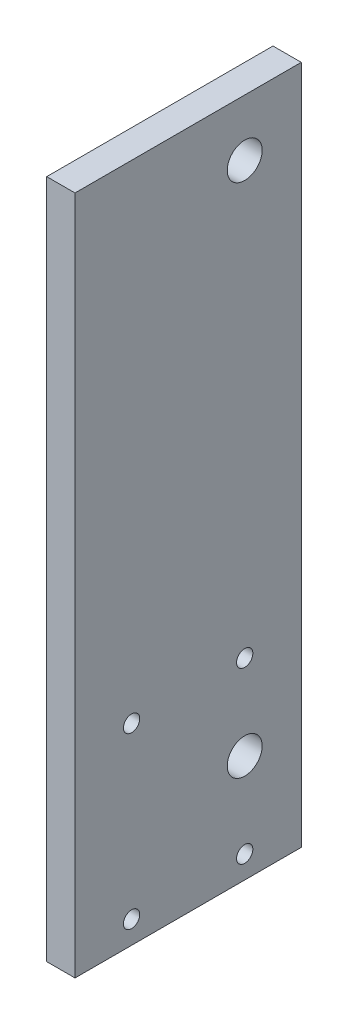
ISO-10303-21;
HEADER;
FILE_DESCRIPTION(('STEP AP214'),'2;1');
FILE_NAME('part.step','',(''),(''),'','','');
FILE_SCHEMA(('AUTOMOTIVE_DESIGN { 1 0 10303 214 1 1 1 1 }'));
ENDSEC;
DATA;
#1=APPLICATION_CONTEXT('core data for automotive mechanical design processes');
#2=APPLICATION_PROTOCOL_DEFINITION('international standard','automotive_design',2000,#1);
#3=PRODUCT_CONTEXT('',#1,'mechanical');
#4=PRODUCT('Part','Part','',(#3));
#5=PRODUCT_RELATED_PRODUCT_CATEGORY('part','',(#4));
#6=PRODUCT_DEFINITION_FORMATION('','',#4);
#7=PRODUCT_DEFINITION_CONTEXT('part definition',#1,'design');
#8=PRODUCT_DEFINITION('design','',#6,#7);
#9=PRODUCT_DEFINITION_SHAPE('','',#8);
#10=(LENGTH_UNIT() NAMED_UNIT(*) SI_UNIT(.MILLI.,.METRE.));
#11=(NAMED_UNIT(*) PLANE_ANGLE_UNIT() SI_UNIT($,.RADIAN.));
#12=(NAMED_UNIT(*) SI_UNIT($,.STERADIAN.) SOLID_ANGLE_UNIT());
#13=UNCERTAINTY_MEASURE_WITH_UNIT(LENGTH_MEASURE(1.E-05),#10,'distance_accuracy_value','');
#14=(GEOMETRIC_REPRESENTATION_CONTEXT(3) GLOBAL_UNCERTAINTY_ASSIGNED_CONTEXT((#13)) GLOBAL_UNIT_ASSIGNED_CONTEXT((#10,
#11,#12)) REPRESENTATION_CONTEXT('',''));
#15=CARTESIAN_POINT('',(0.,0.,0.));
#16=DIRECTION('',(0.,0.,1.));
#17=DIRECTION('',(1.,0.,0.));
#18=AXIS2_PLACEMENT_3D('',#15,#16,#17);
#19=CARTESIAN_POINT('',(3.175,0.,0.));
#20=DIRECTION('',(-1.,0.,0.));
#21=DIRECTION('',(0.,0.,1.));
#22=AXIS2_PLACEMENT_3D('',#19,#20,#21);
#23=PLANE('',#22);
#24=CARTESIAN_POINT('',(3.175,-96.774,0.));
#25=DIRECTION('',(-1.,0.,0.));
#26=DIRECTION('',(0.,0.,1.));
#27=AXIS2_PLACEMENT_3D('',#24,#25,#26);
#28=CIRCLE('',#27,1.82879999999999);
#29=CARTESIAN_POINT('',(3.175,-96.774,1.8288));
#30=VERTEX_POINT('',#29);
#31=EDGE_CURVE('E140',#30,#30,#28,.T.);
#32=ORIENTED_EDGE('',*,*,#31,.T.);
#33=EDGE_LOOP('',(#32));
#34=FACE_BOUND('',#33,.T.);
#35=CARTESIAN_POINT('',(3.175,-96.774,25.4));
#36=DIRECTION('',(-1.,0.,0.));
#37=DIRECTION('',(0.,0.,1.));
#38=AXIS2_PLACEMENT_3D('',#35,#36,#37);
#39=CIRCLE('',#38,1.82879999999999);
#40=CARTESIAN_POINT('',(3.175,-96.774,27.2288));
#41=VERTEX_POINT('',#40);
#42=EDGE_CURVE('E134',#41,#41,#39,.T.);
#43=ORIENTED_EDGE('',*,*,#42,.T.);
#44=EDGE_LOOP('',(#43));
#45=FACE_BOUND('',#44,.T.);
#46=CARTESIAN_POINT('',(3.175,-134.874,25.4));
#47=DIRECTION('',(-1.,0.,0.));
#48=DIRECTION('',(0.,0.,1.));
#49=AXIS2_PLACEMENT_3D('',#46,#47,#48);
#50=CIRCLE('',#49,1.82879999999999);
#51=CARTESIAN_POINT('',(3.175,-134.874,27.2288));
#52=VERTEX_POINT('',#51);
#53=EDGE_CURVE('E128',#52,#52,#50,.T.);
#54=ORIENTED_EDGE('',*,*,#53,.T.);
#55=EDGE_LOOP('',(#54));
#56=FACE_BOUND('',#55,.T.);
#57=CARTESIAN_POINT('',(3.175,-134.874,0.));
#58=DIRECTION('',(-1.,0.,0.));
#59=DIRECTION('',(0.,0.,1.));
#60=AXIS2_PLACEMENT_3D('',#57,#58,#59);
#61=CIRCLE('',#60,1.82879999999999);
#62=CARTESIAN_POINT('',(3.175,-134.874,1.82879999999999));
#63=VERTEX_POINT('',#62);
#64=EDGE_CURVE('E120',#63,#63,#61,.T.);
#65=ORIENTED_EDGE('',*,*,#64,.T.);
#66=EDGE_LOOP('',(#65));
#67=FACE_BOUND('',#66,.T.);
#68=DIRECTION('',(0.,1.,0.));
#69=VECTOR('',#68,1.);
#70=CARTESIAN_POINT('',(3.175,12.7,-12.7));
#71=LINE('',#70,#69);
#72=CARTESIAN_POINT('',(3.175,-139.954,-12.7));
#73=VERTEX_POINT('',#72);
#74=CARTESIAN_POINT('',(3.175,12.7,-12.7));
#75=VERTEX_POINT('',#74);
#76=EDGE_CURVE('E84',#73,#75,#71,.T.);
#77=ORIENTED_EDGE('',*,*,#76,.T.);
#78=DIRECTION('',(0.,0.,1.));
#79=VECTOR('',#78,1.);
#80=CARTESIAN_POINT('',(3.175,12.7,-12.7));
#81=LINE('',#80,#79);
#82=CARTESIAN_POINT('',(3.175,12.7,38.1));
#83=VERTEX_POINT('',#82);
#84=EDGE_CURVE('E79',#75,#83,#81,.T.);
#85=ORIENTED_EDGE('',*,*,#84,.T.);
#86=DIRECTION('',(0.,-1.,0.));
#87=VECTOR('',#86,1.);
#88=CARTESIAN_POINT('',(3.175,12.7,38.1));
#89=LINE('',#88,#87);
#90=CARTESIAN_POINT('',(3.175,-139.954,38.1));
#91=VERTEX_POINT('',#90);
#92=EDGE_CURVE('E82',#83,#91,#89,.T.);
#93=ORIENTED_EDGE('',*,*,#92,.T.);
#94=DIRECTION('',(0.,0.,-1.));
#95=VECTOR('',#94,1.);
#96=CARTESIAN_POINT('',(3.175,-139.954,-12.7));
#97=LINE('',#96,#95);
#98=EDGE_CURVE('E49',#91,#73,#97,.T.);
#99=ORIENTED_EDGE('',*,*,#98,.T.);
#100=EDGE_LOOP('',(#77,#85,#93,#99));
#101=FACE_BOUND('',#100,.T.);
#102=CARTESIAN_POINT('',(3.175,0.,0.));
#103=DIRECTION('',(1.,0.,0.));
#104=DIRECTION('',(0.,0.,-1.));
#105=AXIS2_PLACEMENT_3D('',#102,#103,#104);
#106=CIRCLE('',#105,3.925);
#107=CARTESIAN_POINT('',(3.175,0.,-3.925));
#108=VERTEX_POINT('',#107);
#109=EDGE_CURVE('E99',#108,#108,#106,.T.);
#110=ORIENTED_EDGE('',*,*,#109,.F.);
#111=EDGE_LOOP('',(#110));
#112=FACE_BOUND('',#111,.T.);
#113=CARTESIAN_POINT('',(3.175,-115.824,0.));
#114=DIRECTION('',(1.,0.,0.));
#115=DIRECTION('',(0.,0.,-1.));
#116=AXIS2_PLACEMENT_3D('',#113,#114,#115);
#117=CIRCLE('',#116,3.925);
#118=CARTESIAN_POINT('',(3.175,-115.824,-3.925));
#119=VERTEX_POINT('',#118);
#120=EDGE_CURVE('E114',#119,#119,#117,.T.);
#121=ORIENTED_EDGE('',*,*,#120,.F.);
#122=EDGE_LOOP('',(#121));
#123=FACE_BOUND('',#122,.T.);
#124=ADVANCED_FACE('F32',(#34,#45,#56,#67,#101,#112,#123),#23,.F.);
#125=CARTESIAN_POINT('',(-3.175,0.,0.));
#126=DIRECTION('',(-1.,0.,0.));
#127=DIRECTION('',(0.,0.,1.));
#128=AXIS2_PLACEMENT_3D('',#125,#126,#127);
#129=PLANE('',#128);
#130=CARTESIAN_POINT('',(-3.175,-96.774,0.));
#131=DIRECTION('',(-1.,0.,0.));
#132=DIRECTION('',(0.,0.,1.));
#133=AXIS2_PLACEMENT_3D('',#130,#131,#132);
#134=CIRCLE('',#133,1.82879999999999);
#135=CARTESIAN_POINT('',(-3.175,-96.774,1.8288));
#136=VERTEX_POINT('',#135);
#137=EDGE_CURVE('E143',#136,#136,#134,.T.);
#138=ORIENTED_EDGE('',*,*,#137,.F.);
#139=EDGE_LOOP('',(#138));
#140=FACE_BOUND('',#139,.T.);
#141=CARTESIAN_POINT('',(-3.175,-96.774,25.4));
#142=DIRECTION('',(-1.,0.,0.));
#143=DIRECTION('',(0.,0.,1.));
#144=AXIS2_PLACEMENT_3D('',#141,#142,#143);
#145=CIRCLE('',#144,1.82879999999999);
#146=CARTESIAN_POINT('',(-3.175,-96.774,27.2288));
#147=VERTEX_POINT('',#146);
#148=EDGE_CURVE('E137',#147,#147,#145,.T.);
#149=ORIENTED_EDGE('',*,*,#148,.F.);
#150=EDGE_LOOP('',(#149));
#151=FACE_BOUND('',#150,.T.);
#152=CARTESIAN_POINT('',(-3.175,-134.874,25.4));
#153=DIRECTION('',(-1.,0.,0.));
#154=DIRECTION('',(0.,0.,1.));
#155=AXIS2_PLACEMENT_3D('',#152,#153,#154);
#156=CIRCLE('',#155,1.82879999999999);
#157=CARTESIAN_POINT('',(-3.175,-134.874,27.2288));
#158=VERTEX_POINT('',#157);
#159=EDGE_CURVE('E131',#158,#158,#156,.T.);
#160=ORIENTED_EDGE('',*,*,#159,.F.);
#161=EDGE_LOOP('',(#160));
#162=FACE_BOUND('',#161,.T.);
#163=CARTESIAN_POINT('',(-3.175,-134.874,0.));
#164=DIRECTION('',(-1.,0.,0.));
#165=DIRECTION('',(0.,0.,1.));
#166=AXIS2_PLACEMENT_3D('',#163,#164,#165);
#167=CIRCLE('',#166,1.82879999999999);
#168=CARTESIAN_POINT('',(-3.175,-134.874,1.82879999999999));
#169=VERTEX_POINT('',#168);
#170=EDGE_CURVE('E125',#169,#169,#167,.T.);
#171=ORIENTED_EDGE('',*,*,#170,.F.);
#172=EDGE_LOOP('',(#171));
#173=FACE_BOUND('',#172,.T.);
#174=CARTESIAN_POINT('',(-3.175,0.,0.));
#175=DIRECTION('',(1.,0.,0.));
#176=DIRECTION('',(0.,0.,-1.));
#177=AXIS2_PLACEMENT_3D('',#174,#175,#176);
#178=CIRCLE('',#177,3.925);
#179=CARTESIAN_POINT('',(-3.175,0.,-3.925));
#180=VERTEX_POINT('',#179);
#181=EDGE_CURVE('E111',#180,#180,#178,.T.);
#182=ORIENTED_EDGE('',*,*,#181,.T.);
#183=EDGE_LOOP('',(#182));
#184=FACE_BOUND('',#183,.T.);
#185=DIRECTION('',(0.,1.,0.));
#186=VECTOR('',#185,1.);
#187=CARTESIAN_POINT('',(-3.175,12.7,-12.7));
#188=LINE('',#187,#186);
#189=CARTESIAN_POINT('',(-3.175,-139.954,-12.7));
#190=VERTEX_POINT('',#189);
#191=CARTESIAN_POINT('',(-3.175,12.7,-12.7));
#192=VERTEX_POINT('',#191);
#193=EDGE_CURVE('E96',#190,#192,#188,.T.);
#194=ORIENTED_EDGE('',*,*,#193,.F.);
#195=DIRECTION('',(0.,0.,-1.));
#196=VECTOR('',#195,1.);
#197=CARTESIAN_POINT('',(-3.175,-139.954,-12.7));
#198=LINE('',#197,#196);
#199=CARTESIAN_POINT('',(-3.175,-139.954,38.1));
#200=VERTEX_POINT('',#199);
#201=EDGE_CURVE('E72',#200,#190,#198,.T.);
#202=ORIENTED_EDGE('',*,*,#201,.F.);
#203=DIRECTION('',(0.,-1.,0.));
#204=VECTOR('',#203,1.);
#205=CARTESIAN_POINT('',(-3.175,12.7,38.1));
#206=LINE('',#205,#204);
#207=CARTESIAN_POINT('',(-3.175,12.7,38.1));
#208=VERTEX_POINT('',#207);
#209=EDGE_CURVE('E66',#208,#200,#206,.T.);
#210=ORIENTED_EDGE('',*,*,#209,.F.);
#211=DIRECTION('',(0.,0.,1.));
#212=VECTOR('',#211,1.);
#213=CARTESIAN_POINT('',(-3.175,12.7,-12.7));
#214=LINE('',#213,#212);
#215=EDGE_CURVE('E88',#192,#208,#214,.T.);
#216=ORIENTED_EDGE('',*,*,#215,.F.);
#217=EDGE_LOOP('',(#194,#202,#210,#216));
#218=FACE_BOUND('',#217,.T.);
#219=CARTESIAN_POINT('',(-3.175,-115.824,0.));
#220=DIRECTION('',(1.,0.,0.));
#221=DIRECTION('',(0.,0.,-1.));
#222=AXIS2_PLACEMENT_3D('',#219,#220,#221);
#223=CIRCLE('',#222,3.925);
#224=CARTESIAN_POINT('',(-3.175,-115.824,-3.925));
#225=VERTEX_POINT('',#224);
#226=EDGE_CURVE('E117',#225,#225,#223,.T.);
#227=ORIENTED_EDGE('',*,*,#226,.T.);
#228=EDGE_LOOP('',(#227));
#229=FACE_BOUND('',#228,.T.);
#230=ADVANCED_FACE('F107',(#140,#151,#162,#173,#184,#218,#229),#129,.T.);
#231=CARTESIAN_POINT('',(3.175,12.7,-12.7));
#232=DIRECTION('',(0.,0.,1.));
#233=DIRECTION('',(0.,-1.,0.));
#234=AXIS2_PLACEMENT_3D('',#231,#232,#233);
#235=PLANE('',#234);
#236=ORIENTED_EDGE('',*,*,#193,.T.);
#237=DIRECTION('',(-1.,0.,0.));
#238=VECTOR('',#237,1.);
#239=CARTESIAN_POINT('',(3.175,12.7,-12.7));
#240=LINE('',#239,#238);
#241=EDGE_CURVE('E11',#75,#192,#240,.T.);
#242=ORIENTED_EDGE('',*,*,#241,.F.);
#243=ORIENTED_EDGE('',*,*,#76,.F.);
#244=DIRECTION('',(-1.,0.,0.));
#245=VECTOR('',#244,1.);
#246=CARTESIAN_POINT('',(3.175,-139.954,-12.7));
#247=LINE('',#246,#245);
#248=EDGE_CURVE('E92',#73,#190,#247,.T.);
#249=ORIENTED_EDGE('',*,*,#248,.T.);
#250=EDGE_LOOP('',(#236,#242,#243,#249));
#251=FACE_BOUND('',#250,.T.);
#252=ADVANCED_FACE('F34',(#251),#235,.F.);
#253=CARTESIAN_POINT('',(3.175,12.7,-12.7));
#254=DIRECTION('',(0.,-1.,0.));
#255=DIRECTION('',(0.,0.,-1.));
#256=AXIS2_PLACEMENT_3D('',#253,#254,#255);
#257=PLANE('',#256);
#258=ORIENTED_EDGE('',*,*,#215,.T.);
#259=DIRECTION('',(-1.,0.,0.));
#260=VECTOR('',#259,1.);
#261=CARTESIAN_POINT('',(3.175,12.7,38.1));
#262=LINE('',#261,#260);
#263=EDGE_CURVE('E41',#83,#208,#262,.T.);
#264=ORIENTED_EDGE('',*,*,#263,.F.);
#265=ORIENTED_EDGE('',*,*,#84,.F.);
#266=ORIENTED_EDGE('',*,*,#241,.T.);
#267=EDGE_LOOP('',(#258,#264,#265,#266));
#268=FACE_BOUND('',#267,.T.);
#269=ADVANCED_FACE('F87',(#268),#257,.F.);
#270=CARTESIAN_POINT('',(3.175,12.7,38.1));
#271=DIRECTION('',(0.,0.,-1.));
#272=DIRECTION('',(0.,1.,0.));
#273=AXIS2_PLACEMENT_3D('',#270,#271,#272);
#274=PLANE('',#273);
#275=ORIENTED_EDGE('',*,*,#209,.T.);
#276=DIRECTION('',(-1.,0.,0.));
#277=VECTOR('',#276,1.);
#278=CARTESIAN_POINT('',(3.175,-139.954,38.1));
#279=LINE('',#278,#277);
#280=EDGE_CURVE('E89',#91,#200,#279,.T.);
#281=ORIENTED_EDGE('',*,*,#280,.F.);
#282=ORIENTED_EDGE('',*,*,#92,.F.);
#283=ORIENTED_EDGE('',*,*,#263,.T.);
#284=EDGE_LOOP('',(#275,#281,#282,#283));
#285=FACE_BOUND('',#284,.T.);
#286=ADVANCED_FACE('F90',(#285),#274,.F.);
#287=CARTESIAN_POINT('',(3.175,-139.954,-12.7));
#288=DIRECTION('',(0.,1.,0.));
#289=DIRECTION('',(0.,0.,1.));
#290=AXIS2_PLACEMENT_3D('',#287,#288,#289);
#291=PLANE('',#290);
#292=ORIENTED_EDGE('',*,*,#201,.T.);
#293=ORIENTED_EDGE('',*,*,#248,.F.);
#294=ORIENTED_EDGE('',*,*,#98,.F.);
#295=ORIENTED_EDGE('',*,*,#280,.T.);
#296=EDGE_LOOP('',(#292,#293,#294,#295));
#297=FACE_BOUND('',#296,.T.);
#298=ADVANCED_FACE('F104',(#297),#291,.F.);
#299=CARTESIAN_POINT('',(3.175,0.,0.));
#300=DIRECTION('',(-1.,0.,0.));
#301=DIRECTION('',(0.,0.,1.));
#302=AXIS2_PLACEMENT_3D('',#299,#300,#301);
#303=CYLINDRICAL_SURFACE('',#302,3.925);
#304=ORIENTED_EDGE('',*,*,#109,.T.);
#305=EDGE_LOOP('',(#304));
#306=FACE_BOUND('',#305,.T.);
#307=ORIENTED_EDGE('',*,*,#181,.F.);
#308=EDGE_LOOP('',(#307));
#309=FACE_BOUND('',#308,.T.);
#310=ADVANCED_FACE('F160',(#306,#309),#303,.F.);
#311=CARTESIAN_POINT('',(3.175,-115.824,0.));
#312=DIRECTION('',(-1.,0.,0.));
#313=DIRECTION('',(0.,0.,1.));
#314=AXIS2_PLACEMENT_3D('',#311,#312,#313);
#315=CYLINDRICAL_SURFACE('',#314,3.925);
#316=ORIENTED_EDGE('',*,*,#120,.T.);
#317=EDGE_LOOP('',(#316));
#318=FACE_BOUND('',#317,.T.);
#319=ORIENTED_EDGE('',*,*,#226,.F.);
#320=EDGE_LOOP('',(#319));
#321=FACE_BOUND('',#320,.T.);
#322=ADVANCED_FACE('F162',(#318,#321),#315,.F.);
#323=CARTESIAN_POINT('',(-3.175,-134.874,0.));
#324=DIRECTION('',(-1.,0.,0.));
#325=DIRECTION('',(0.,0.,1.));
#326=AXIS2_PLACEMENT_3D('',#323,#324,#325);
#327=CYLINDRICAL_SURFACE('',#326,1.82879999999999);
#328=ORIENTED_EDGE('',*,*,#64,.F.);
#329=EDGE_LOOP('',(#328));
#330=FACE_BOUND('',#329,.T.);
#331=ORIENTED_EDGE('',*,*,#170,.T.);
#332=EDGE_LOOP('',(#331));
#333=FACE_BOUND('',#332,.T.);
#334=ADVANCED_FACE('F169',(#330,#333),#327,.F.);
#335=CARTESIAN_POINT('',(-3.175,-134.874,25.4));
#336=DIRECTION('',(-1.,0.,0.));
#337=DIRECTION('',(0.,0.,1.));
#338=AXIS2_PLACEMENT_3D('',#335,#336,#337);
#339=CYLINDRICAL_SURFACE('',#338,1.82879999999999);
#340=ORIENTED_EDGE('',*,*,#53,.F.);
#341=EDGE_LOOP('',(#340));
#342=FACE_BOUND('',#341,.T.);
#343=ORIENTED_EDGE('',*,*,#159,.T.);
#344=EDGE_LOOP('',(#343));
#345=FACE_BOUND('',#344,.T.);
#346=ADVANCED_FACE('F203',(#342,#345),#339,.F.);
#347=CARTESIAN_POINT('',(-3.175,-96.774,25.4));
#348=DIRECTION('',(-1.,0.,0.));
#349=DIRECTION('',(0.,0.,1.));
#350=AXIS2_PLACEMENT_3D('',#347,#348,#349);
#351=CYLINDRICAL_SURFACE('',#350,1.82879999999999);
#352=ORIENTED_EDGE('',*,*,#42,.F.);
#353=EDGE_LOOP('',(#352));
#354=FACE_BOUND('',#353,.T.);
#355=ORIENTED_EDGE('',*,*,#148,.T.);
#356=EDGE_LOOP('',(#355));
#357=FACE_BOUND('',#356,.T.);
#358=ADVANCED_FACE('F214',(#354,#357),#351,.F.);
#359=CARTESIAN_POINT('',(-3.175,-96.774,0.));
#360=DIRECTION('',(-1.,0.,0.));
#361=DIRECTION('',(0.,0.,1.));
#362=AXIS2_PLACEMENT_3D('',#359,#360,#361);
#363=CYLINDRICAL_SURFACE('',#362,1.82879999999999);
#364=ORIENTED_EDGE('',*,*,#31,.F.);
#365=EDGE_LOOP('',(#364));
#366=FACE_BOUND('',#365,.T.);
#367=ORIENTED_EDGE('',*,*,#137,.T.);
#368=EDGE_LOOP('',(#367));
#369=FACE_BOUND('',#368,.T.);
#370=ADVANCED_FACE('F147',(#366,#369),#363,.F.);
#371=CLOSED_SHELL('',(#124,#230,#252,#269,#286,#298,#310,#322,#334,#346,#358,#370));
#372=MANIFOLD_SOLID_BREP('B2',#371);
#373=ADVANCED_BREP_SHAPE_REPRESENTATION('',(#18,#372),#14);
#374=SHAPE_DEFINITION_REPRESENTATION(#9,#373);
ENDSEC;
END-ISO-10303-21;
